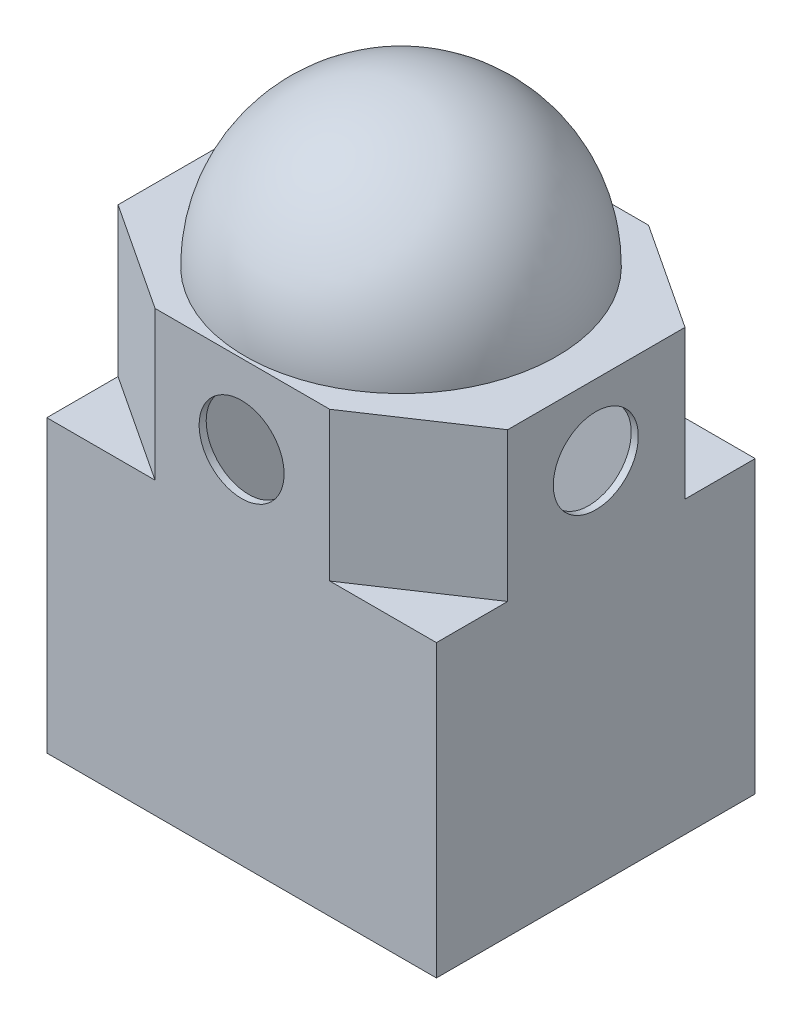
ISO-10303-21;
HEADER;
FILE_DESCRIPTION(('STEP AP214'),'2;1');
FILE_NAME('part.step','',(''),(''),'','','');
FILE_SCHEMA(('AUTOMOTIVE_DESIGN { 1 0 10303 214 1 1 1 1 }'));
ENDSEC;
DATA;
#1=APPLICATION_CONTEXT('core data for automotive mechanical design processes');
#2=APPLICATION_PROTOCOL_DEFINITION('international standard','automotive_design',2000,#1);
#3=PRODUCT_CONTEXT('',#1,'mechanical');
#4=PRODUCT('Part','Part','',(#3));
#5=PRODUCT_RELATED_PRODUCT_CATEGORY('part','',(#4));
#6=PRODUCT_DEFINITION_FORMATION('','',#4);
#7=PRODUCT_DEFINITION_CONTEXT('part definition',#1,'design');
#8=PRODUCT_DEFINITION('design','',#6,#7);
#9=PRODUCT_DEFINITION_SHAPE('','',#8);
#10=(LENGTH_UNIT() NAMED_UNIT(*) SI_UNIT(.MILLI.,.METRE.));
#11=(NAMED_UNIT(*) PLANE_ANGLE_UNIT() SI_UNIT($,.RADIAN.));
#12=(NAMED_UNIT(*) SI_UNIT($,.STERADIAN.) SOLID_ANGLE_UNIT());
#13=UNCERTAINTY_MEASURE_WITH_UNIT(LENGTH_MEASURE(1.E-05),#10,'distance_accuracy_value','');
#14=(GEOMETRIC_REPRESENTATION_CONTEXT(3) GLOBAL_UNCERTAINTY_ASSIGNED_CONTEXT((#13)) GLOBAL_UNIT_ASSIGNED_CONTEXT((#10,
#11,#12)) REPRESENTATION_CONTEXT('',''));
#15=CARTESIAN_POINT('',(0.,0.,0.));
#16=DIRECTION('',(0.,0.,1.));
#17=DIRECTION('',(1.,0.,0.));
#18=AXIS2_PLACEMENT_3D('',#15,#16,#17);
#19=CARTESIAN_POINT('',(0.,124.,0.));
#20=DIRECTION('',(0.,-1.,0.));
#21=DIRECTION('',(0.,0.,-1.));
#22=AXIS2_PLACEMENT_3D('',#19,#20,#21);
#23=PLANE('',#22);
#24=DIRECTION('',(1.,0.,0.));
#25=VECTOR('',#24,1.);
#26=CARTESIAN_POINT('',(11.5,124.,6.5));
#27=LINE('',#26,#25);
#28=CARTESIAN_POINT('',(-11.5,124.,6.5));
#29=VERTEX_POINT('',#28);
#30=CARTESIAN_POINT('',(11.5,124.,6.5));
#31=VERTEX_POINT('',#30);
#32=EDGE_CURVE('E234',#29,#31,#27,.T.);
#33=ORIENTED_EDGE('',*,*,#32,.F.);
#34=DIRECTION('',(0.,0.,1.));
#35=VECTOR('',#34,1.);
#36=CARTESIAN_POINT('',(-11.5,124.,-6.5));
#37=LINE('',#36,#35);
#38=CARTESIAN_POINT('',(-11.5,124.,-6.5));
#39=VERTEX_POINT('',#38);
#40=EDGE_CURVE('E60',#39,#29,#37,.T.);
#41=ORIENTED_EDGE('',*,*,#40,.F.);
#42=DIRECTION('',(-1.,0.,0.));
#43=VECTOR('',#42,1.);
#44=CARTESIAN_POINT('',(11.5,124.,-6.5));
#45=LINE('',#44,#43);
#46=CARTESIAN_POINT('',(11.5,124.,-6.5));
#47=VERTEX_POINT('',#46);
#48=EDGE_CURVE('E240',#47,#39,#45,.T.);
#49=ORIENTED_EDGE('',*,*,#48,.F.);
#50=DIRECTION('',(0.,0.,-1.));
#51=VECTOR('',#50,1.);
#52=CARTESIAN_POINT('',(11.5,124.,-6.5));
#53=LINE('',#52,#51);
#54=EDGE_CURVE('E225',#31,#47,#53,.T.);
#55=ORIENTED_EDGE('',*,*,#54,.F.);
#56=EDGE_LOOP('',(#33,#41,#49,#55));
#57=FACE_BOUND('',#56,.T.);
#58=CARTESIAN_POINT('',(0.,124.,0.));
#59=DIRECTION('',(0.,-1.,0.));
#60=DIRECTION('',(1.,0.,0.));
#61=AXIS2_PLACEMENT_3D('',#58,#59,#60);
#62=CIRCLE('',#61,41.9958270484397);
#63=CARTESIAN_POINT('',(41.9958270484397,124.,0.));
#64=VERTEX_POINT('',#63);
#65=EDGE_CURVE('E458',#64,#64,#62,.T.);
#66=ORIENTED_EDGE('',*,*,#65,.F.);
#67=EDGE_LOOP('',(#66));
#68=FACE_BOUND('',#67,.T.);
#69=ADVANCED_FACE('F35',(#57,#68),#23,.F.);
#70=CARTESIAN_POINT('',(0.,80.,0.));
#71=DIRECTION('',(0.,1.,0.));
#72=DIRECTION('',(0.,0.,1.));
#73=AXIS2_PLACEMENT_3D('',#70,#71,#72);
#74=PLANE('',#73);
#75=DIRECTION('',(0.,0.,-1.));
#76=VECTOR('',#75,1.);
#77=CARTESIAN_POINT('',(53.,80.,-43.));
#78=LINE('',#77,#76);
#79=CARTESIAN_POINT('',(53.,80.,-24.1000047461894));
#80=VERTEX_POINT('',#79);
#81=CARTESIAN_POINT('',(53.,80.,-43.));
#82=VERTEX_POINT('',#81);
#83=EDGE_CURVE('E377',#80,#82,#78,.T.);
#84=ORIENTED_EDGE('',*,*,#83,.F.);
#85=DIRECTION('',(-0.835308360991126,0.,-0.549781722193743));
#86=VECTOR('',#85,1.);
#87=CARTESIAN_POINT('',(27.0873972980896,80.,-41.1551139792333));
#88=LINE('',#87,#86);
#89=CARTESIAN_POINT('',(24.2843781069951,80.,-43.));
#90=VERTEX_POINT('',#89);
#91=EDGE_CURVE('E44',#80,#90,#88,.T.);
#92=ORIENTED_EDGE('',*,*,#91,.T.);
#93=DIRECTION('',(-1.,0.,0.));
#94=VECTOR('',#93,1.);
#95=CARTESIAN_POINT('',(-53.,80.,-43.));
#96=LINE('',#95,#94);
#97=EDGE_CURVE('E382',#82,#90,#96,.T.);
#98=ORIENTED_EDGE('',*,*,#97,.F.);
#99=EDGE_LOOP('',(#84,#92,#98));
#100=FACE_BOUND('',#99,.T.);
#101=ADVANCED_FACE('F464',(#100),#74,.F.);
#102=DIRECTION('',(1.,0.,0.));
#103=VECTOR('',#102,1.);
#104=CARTESIAN_POINT('',(-53.,80.,43.));
#105=LINE('',#104,#103);
#106=CARTESIAN_POINT('',(24.2769691697941,80.,43.));
#107=VERTEX_POINT('',#106);
#108=CARTESIAN_POINT('',(53.,80.,43.));
#109=VERTEX_POINT('',#108);
#110=EDGE_CURVE('E372',#107,#109,#105,.T.);
#111=ORIENTED_EDGE('',*,*,#110,.F.);
#112=DIRECTION('',(0.831555061112771,0.,-0.55544232854342));
#113=VECTOR('',#112,1.);
#114=CARTESIAN_POINT('',(27.3507156150732,80.,40.9468721161612));
#115=LINE('',#114,#113);
#116=CARTESIAN_POINT('',(53.,80.,23.8142745162242));
#117=VERTEX_POINT('',#116);
#118=EDGE_CURVE('E433',#107,#117,#115,.T.);
#119=ORIENTED_EDGE('',*,*,#118,.T.);
#120=EDGE_CURVE('E378',#109,#117,#78,.T.);
#121=ORIENTED_EDGE('',*,*,#120,.F.);
#122=EDGE_LOOP('',(#111,#119,#121));
#123=FACE_BOUND('',#122,.T.);
#124=ADVANCED_FACE('F470',(#123),#74,.F.);
#125=DIRECTION('',(0.,0.,1.));
#126=VECTOR('',#125,1.);
#127=CARTESIAN_POINT('',(-53.,80.,-43.));
#128=LINE('',#127,#126);
#129=CARTESIAN_POINT('',(-53.,80.,23.8055255205694));
#130=VERTEX_POINT('',#129);
#131=CARTESIAN_POINT('',(-53.,80.,43.));
#132=VERTEX_POINT('',#131);
#133=EDGE_CURVE('E373',#130,#132,#128,.T.);
#134=ORIENTED_EDGE('',*,*,#133,.F.);
#135=DIRECTION('',(0.835308360991126,0.,0.549781722193743));
#136=VECTOR('',#135,1.);
#137=CARTESIAN_POINT('',(-26.9521614626596,80.,40.9496440272866));
#138=LINE('',#137,#136);
#139=CARTESIAN_POINT('',(-23.8369624338856,80.,43.));
#140=VERTEX_POINT('',#139);
#141=EDGE_CURVE('E430',#130,#140,#138,.T.);
#142=ORIENTED_EDGE('',*,*,#141,.T.);
#143=EDGE_CURVE('E374',#132,#140,#105,.T.);
#144=ORIENTED_EDGE('',*,*,#143,.F.);
#145=EDGE_LOOP('',(#134,#142,#144));
#146=FACE_BOUND('',#145,.T.);
#147=ADVANCED_FACE('F544',(#146),#74,.F.);
#148=CARTESIAN_POINT('',(0.,82.,0.));
#149=DIRECTION('',(0.,1.,0.));
#150=DIRECTION('',(0.,0.,1.));
#151=AXIS2_PLACEMENT_3D('',#148,#149,#150);
#152=PLANE('',#151);
#153=DIRECTION('',(0.83155506111277,0.,-0.55544232854342));
#154=VECTOR('',#153,1.);
#155=CARTESIAN_POINT('',(24.883494564893,82.,45.));
#156=LINE('',#155,#154);
#157=CARTESIAN_POINT('',(24.8834945648931,82.,45.));
#158=VERTEX_POINT('',#157);
#159=CARTESIAN_POINT('',(55.,82.,24.8834945648923));
#160=VERTEX_POINT('',#159);
#161=EDGE_CURVE('E329',#158,#160,#156,.T.);
#162=ORIENTED_EDGE('',*,*,#161,.F.);
#163=DIRECTION('',(1.,0.,0.));
#164=VECTOR('',#163,1.);
#165=CARTESIAN_POINT('',(-55.,82.,45.));
#166=LINE('',#165,#164);
#167=CARTESIAN_POINT('',(55.,82.,45.));
#168=VERTEX_POINT('',#167);
#169=EDGE_CURVE('E365',#158,#168,#166,.T.);
#170=ORIENTED_EDGE('',*,*,#169,.T.);
#171=DIRECTION('',(0.,0.,-1.));
#172=VECTOR('',#171,1.);
#173=CARTESIAN_POINT('',(55.,82.,-45.));
#174=LINE('',#173,#172);
#175=EDGE_CURVE('E357',#168,#160,#174,.T.);
#176=ORIENTED_EDGE('',*,*,#175,.T.);
#177=EDGE_LOOP('',(#162,#170,#176));
#178=FACE_BOUND('',#177,.T.);
#179=ADVANCED_FACE('F525',(#178),#152,.T.);
#180=DIRECTION('',(0.835308360991126,0.,0.549781722193743));
#181=VECTOR('',#180,1.);
#182=CARTESIAN_POINT('',(-55.,82.,24.8834945648923));
#183=LINE('',#182,#181);
#184=CARTESIAN_POINT('',(-55.,82.,24.8834945648923));
#185=VERTEX_POINT('',#184);
#186=CARTESIAN_POINT('',(-24.4360788917836,82.,45.));
#187=VERTEX_POINT('',#186);
#188=EDGE_CURVE('E326',#185,#187,#183,.T.);
#189=ORIENTED_EDGE('',*,*,#188,.F.);
#190=DIRECTION('',(0.,0.,1.));
#191=VECTOR('',#190,1.);
#192=CARTESIAN_POINT('',(-55.,82.,-45.));
#193=LINE('',#192,#191);
#194=CARTESIAN_POINT('',(-55.,82.,45.));
#195=VERTEX_POINT('',#194);
#196=EDGE_CURVE('E362',#185,#195,#193,.T.);
#197=ORIENTED_EDGE('',*,*,#196,.T.);
#198=EDGE_CURVE('E366',#195,#187,#166,.T.);
#199=ORIENTED_EDGE('',*,*,#198,.T.);
#200=EDGE_LOOP('',(#189,#197,#199));
#201=FACE_BOUND('',#200,.T.);
#202=ADVANCED_FACE('F546',(#201),#152,.T.);
#203=DIRECTION('',(-0.834067643016127,0.,0.551662185466362));
#204=VECTOR('',#203,1.);
#205=CARTESIAN_POINT('',(-25.0307341777019,82.,-45.));
#206=LINE('',#205,#204);
#207=CARTESIAN_POINT('',(-25.0307341777019,82.,-45.));
#208=VERTEX_POINT('',#207);
#209=CARTESIAN_POINT('',(-55.,82.,-25.1779737905123));
#210=VERTEX_POINT('',#209);
#211=EDGE_CURVE('E323',#208,#210,#206,.T.);
#212=ORIENTED_EDGE('',*,*,#211,.F.);
#213=DIRECTION('',(-1.,0.,0.));
#214=VECTOR('',#213,1.);
#215=CARTESIAN_POINT('',(-55.,82.,-45.));
#216=LINE('',#215,#214);
#217=CARTESIAN_POINT('',(-55.,82.,-45.));
#218=VERTEX_POINT('',#217);
#219=EDGE_CURVE('E359',#208,#218,#216,.T.);
#220=ORIENTED_EDGE('',*,*,#219,.T.);
#221=EDGE_CURVE('E363',#218,#210,#193,.T.);
#222=ORIENTED_EDGE('',*,*,#221,.T.);
#223=EDGE_LOOP('',(#212,#220,#222));
#224=FACE_BOUND('',#223,.T.);
#225=ADVANCED_FACE('F536',(#224),#152,.T.);
#226=CARTESIAN_POINT('',(0.,0.,0.));
#227=DIRECTION('',(0.,1.,0.));
#228=DIRECTION('',(0.,0.,1.));
#229=AXIS2_PLACEMENT_3D('',#226,#227,#228);
#230=PLANE('',#229);
#231=DIRECTION('',(0.,0.,-1.));
#232=VECTOR('',#231,1.);
#233=CARTESIAN_POINT('',(55.,0.,-45.));
#234=LINE('',#233,#232);
#235=CARTESIAN_POINT('',(55.,0.,45.));
#236=VERTEX_POINT('',#235);
#237=CARTESIAN_POINT('',(55.,0.,-45.));
#238=VERTEX_POINT('',#237);
#239=EDGE_CURVE('E406',#236,#238,#234,.T.);
#240=ORIENTED_EDGE('',*,*,#239,.F.);
#241=DIRECTION('',(1.,0.,0.));
#242=VECTOR('',#241,1.);
#243=CARTESIAN_POINT('',(-55.,0.,45.));
#244=LINE('',#243,#242);
#245=CARTESIAN_POINT('',(-55.,0.,45.));
#246=VERTEX_POINT('',#245);
#247=EDGE_CURVE('E413',#246,#236,#244,.T.);
#248=ORIENTED_EDGE('',*,*,#247,.F.);
#249=DIRECTION('',(0.,0.,1.));
#250=VECTOR('',#249,1.);
#251=CARTESIAN_POINT('',(-55.,0.,-45.));
#252=LINE('',#251,#250);
#253=CARTESIAN_POINT('',(-55.,0.,-45.));
#254=VERTEX_POINT('',#253);
#255=EDGE_CURVE('E411',#254,#246,#252,.T.);
#256=ORIENTED_EDGE('',*,*,#255,.F.);
#257=DIRECTION('',(-1.,0.,0.));
#258=VECTOR('',#257,1.);
#259=CARTESIAN_POINT('',(-55.,0.,-45.));
#260=LINE('',#259,#258);
#261=EDGE_CURVE('E409',#238,#254,#260,.T.);
#262=ORIENTED_EDGE('',*,*,#261,.F.);
#263=EDGE_LOOP('',(#240,#248,#256,#262));
#264=FACE_BOUND('',#263,.T.);
#265=DIRECTION('',(0.,0.,1.));
#266=VECTOR('',#265,1.);
#267=CARTESIAN_POINT('',(-53.,0.,-43.));
#268=LINE('',#267,#266);
#269=CARTESIAN_POINT('',(-53.,0.,-43.));
#270=VERTEX_POINT('',#269);
#271=CARTESIAN_POINT('',(-53.,0.,43.));
#272=VERTEX_POINT('',#271);
#273=EDGE_CURVE('E368',#270,#272,#268,.T.);
#274=ORIENTED_EDGE('',*,*,#273,.T.);
#275=DIRECTION('',(1.,0.,0.));
#276=VECTOR('',#275,1.);
#277=CARTESIAN_POINT('',(-53.,0.,43.));
#278=LINE('',#277,#276);
#279=CARTESIAN_POINT('',(53.,0.,43.));
#280=VERTEX_POINT('',#279);
#281=EDGE_CURVE('E388',#272,#280,#278,.T.);
#282=ORIENTED_EDGE('',*,*,#281,.T.);
#283=DIRECTION('',(0.,0.,-1.));
#284=VECTOR('',#283,1.);
#285=CARTESIAN_POINT('',(53.,0.,-43.));
#286=LINE('',#285,#284);
#287=CARTESIAN_POINT('',(53.,0.,-43.));
#288=VERTEX_POINT('',#287);
#289=EDGE_CURVE('E391',#280,#288,#286,.T.);
#290=ORIENTED_EDGE('',*,*,#289,.T.);
#291=DIRECTION('',(-1.,0.,0.));
#292=VECTOR('',#291,1.);
#293=CARTESIAN_POINT('',(-53.,0.,-43.));
#294=LINE('',#293,#292);
#295=EDGE_CURVE('E394',#288,#270,#294,.T.);
#296=ORIENTED_EDGE('',*,*,#295,.T.);
#297=EDGE_LOOP('',(#274,#282,#290,#296));
#298=FACE_BOUND('',#297,.T.);
#299=ADVANCED_FACE('F529',(#264,#298),#230,.F.);
#300=CARTESIAN_POINT('',(55.,80.,-45.));
#301=DIRECTION('',(-1.,0.,0.));
#302=DIRECTION('',(0.,0.,1.));
#303=AXIS2_PLACEMENT_3D('',#300,#301,#302);
#304=PLANE('',#303);
#305=CARTESIAN_POINT('',(55.,103.980631389033,0.));
#306=DIRECTION('',(-1.,0.,0.));
#307=DIRECTION('',(0.,0.,1.));
#308=AXIS2_PLACEMENT_3D('',#305,#306,#307);
#309=CIRCLE('',#308,12.);
#310=CARTESIAN_POINT('',(55.,103.980631389033,12.));
#311=VERTEX_POINT('',#310);
#312=EDGE_CURVE('E447',#311,#311,#309,.T.);
#313=ORIENTED_EDGE('',*,*,#312,.T.);
#314=EDGE_LOOP('',(#313));
#315=FACE_BOUND('',#314,.T.);
#316=ORIENTED_EDGE('',*,*,#239,.T.);
#317=DIRECTION('',(0.,-1.,0.));
#318=VECTOR('',#317,1.);
#319=CARTESIAN_POINT('',(55.,80.,-45.));
#320=LINE('',#319,#318);
#321=CARTESIAN_POINT('',(55.,82.,-45.));
#322=VERTEX_POINT('',#321);
#323=EDGE_CURVE('E424',#322,#238,#320,.T.);
#324=ORIENTED_EDGE('',*,*,#323,.F.);
#325=CARTESIAN_POINT('',(55.,82.,-25.1779737905123));
#326=VERTEX_POINT('',#325);
#327=EDGE_CURVE('E356',#326,#322,#174,.T.);
#328=ORIENTED_EDGE('',*,*,#327,.F.);
#329=DIRECTION('',(0.,-1.,0.));
#330=VECTOR('',#329,1.);
#331=CARTESIAN_POINT('',(55.,122.,-25.1779737905123));
#332=LINE('',#331,#330);
#333=CARTESIAN_POINT('',(55.,124.,-25.1779737905123));
#334=VERTEX_POINT('',#333);
#335=EDGE_CURVE('E353',#334,#326,#332,.T.);
#336=ORIENTED_EDGE('',*,*,#335,.F.);
#337=DIRECTION('',(0.,0.,-1.));
#338=VECTOR('',#337,1.);
#339=CARTESIAN_POINT('',(55.,124.,-25.1779737905123));
#340=LINE('',#339,#338);
#341=CARTESIAN_POINT('',(55.,124.,24.8834945648923));
#342=VERTEX_POINT('',#341);
#343=EDGE_CURVE('E259',#342,#334,#340,.T.);
#344=ORIENTED_EDGE('',*,*,#343,.F.);
#345=DIRECTION('',(0.,-1.,0.));
#346=VECTOR('',#345,1.);
#347=CARTESIAN_POINT('',(55.,122.,24.8834945648923));
#348=LINE('',#347,#346);
#349=EDGE_CURVE('E332',#342,#160,#348,.T.);
#350=ORIENTED_EDGE('',*,*,#349,.T.);
#351=ORIENTED_EDGE('',*,*,#175,.F.);
#352=DIRECTION('',(0.,-1.,0.));
#353=VECTOR('',#352,1.);
#354=CARTESIAN_POINT('',(55.,80.,45.));
#355=LINE('',#354,#353);
#356=EDGE_CURVE('E415',#168,#236,#355,.T.);
#357=ORIENTED_EDGE('',*,*,#356,.T.);
#358=EDGE_LOOP('',(#316,#324,#328,#336,#344,#350,#351,#357));
#359=FACE_BOUND('',#358,.T.);
#360=ADVANCED_FACE('F37',(#315,#359),#304,.F.);
#361=CARTESIAN_POINT('',(-55.,80.,-45.));
#362=DIRECTION('',(0.,0.,1.));
#363=DIRECTION('',(1.,0.,0.));
#364=AXIS2_PLACEMENT_3D('',#361,#362,#363);
#365=PLANE('',#364);
#366=CARTESIAN_POINT('',(0.,101.721715456488,-45.));
#367=DIRECTION('',(0.,0.,-1.));
#368=DIRECTION('',(-1.,0.,0.));
#369=AXIS2_PLACEMENT_3D('',#366,#367,#368);
#370=CIRCLE('',#369,12.);
#371=CARTESIAN_POINT('',(-12.,101.721715456488,-45.));
#372=VERTEX_POINT('',#371);
#373=EDGE_CURVE('E440',#372,#372,#370,.T.);
#374=ORIENTED_EDGE('',*,*,#373,.F.);
#375=EDGE_LOOP('',(#374));
#376=FACE_BOUND('',#375,.T.);
#377=ORIENTED_EDGE('',*,*,#261,.T.);
#378=DIRECTION('',(0.,-1.,0.));
#379=VECTOR('',#378,1.);
#380=CARTESIAN_POINT('',(-55.,80.,-45.));
#381=LINE('',#380,#379);
#382=EDGE_CURVE('E421',#218,#254,#381,.T.);
#383=ORIENTED_EDGE('',*,*,#382,.F.);
#384=ORIENTED_EDGE('',*,*,#219,.F.);
#385=DIRECTION('',(0.,-1.,0.));
#386=VECTOR('',#385,1.);
#387=CARTESIAN_POINT('',(-25.0307341777019,122.,-45.));
#388=LINE('',#387,#386);
#389=CARTESIAN_POINT('',(-25.0307341777019,124.,-45.));
#390=VERTEX_POINT('',#389);
#391=EDGE_CURVE('E347',#390,#208,#388,.T.);
#392=ORIENTED_EDGE('',*,*,#391,.F.);
#393=DIRECTION('',(-1.,0.,0.));
#394=VECTOR('',#393,1.);
#395=CARTESIAN_POINT('',(-25.0307341777019,124.,-45.));
#396=LINE('',#395,#394);
#397=CARTESIAN_POINT('',(24.883494564893,124.,-45.));
#398=VERTEX_POINT('',#397);
#399=EDGE_CURVE('E265',#398,#390,#396,.T.);
#400=ORIENTED_EDGE('',*,*,#399,.F.);
#401=DIRECTION('',(0.,-1.,0.));
#402=VECTOR('',#401,1.);
#403=CARTESIAN_POINT('',(24.883494564893,122.,-45.));
#404=LINE('',#403,#402);
#405=CARTESIAN_POINT('',(24.883494564893,82.,-45.));
#406=VERTEX_POINT('',#405);
#407=EDGE_CURVE('E350',#398,#406,#404,.T.);
#408=ORIENTED_EDGE('',*,*,#407,.T.);
#409=EDGE_CURVE('E360',#322,#406,#216,.T.);
#410=ORIENTED_EDGE('',*,*,#409,.F.);
#411=ORIENTED_EDGE('',*,*,#323,.T.);
#412=EDGE_LOOP('',(#377,#383,#384,#392,#400,#408,#410,#411));
#413=FACE_BOUND('',#412,.T.);
#414=ADVANCED_FACE('F504',(#376,#413),#365,.F.);
#415=CARTESIAN_POINT('',(-55.,80.,-45.));
#416=DIRECTION('',(1.,0.,0.));
#417=DIRECTION('',(0.,0.,-1.));
#418=AXIS2_PLACEMENT_3D('',#415,#416,#417);
#419=PLANE('',#418);
#420=CARTESIAN_POINT('',(-55.,103.980631389033,0.));
#421=DIRECTION('',(-1.,0.,0.));
#422=DIRECTION('',(0.,0.,1.));
#423=AXIS2_PLACEMENT_3D('',#420,#421,#422);
#424=CIRCLE('',#423,12.);
#425=CARTESIAN_POINT('',(-55.,103.980631389033,12.));
#426=VERTEX_POINT('',#425);
#427=EDGE_CURVE('E891',#426,#426,#424,.T.);
#428=ORIENTED_EDGE('',*,*,#427,.F.);
#429=EDGE_LOOP('',(#428));
#430=FACE_BOUND('',#429,.T.);
#431=ORIENTED_EDGE('',*,*,#255,.T.);
#432=DIRECTION('',(0.,-1.,0.));
#433=VECTOR('',#432,1.);
#434=CARTESIAN_POINT('',(-55.,80.,45.));
#435=LINE('',#434,#433);
#436=EDGE_CURVE('E418',#195,#246,#435,.T.);
#437=ORIENTED_EDGE('',*,*,#436,.F.);
#438=ORIENTED_EDGE('',*,*,#196,.F.);
#439=DIRECTION('',(0.,-1.,0.));
#440=VECTOR('',#439,1.);
#441=CARTESIAN_POINT('',(-55.,122.,24.8834945648923));
#442=LINE('',#441,#440);
#443=CARTESIAN_POINT('',(-55.,124.,24.8834945648923));
#444=VERTEX_POINT('',#443);
#445=EDGE_CURVE('E341',#444,#185,#442,.T.);
#446=ORIENTED_EDGE('',*,*,#445,.F.);
#447=DIRECTION('',(0.,0.,1.));
#448=VECTOR('',#447,1.);
#449=CARTESIAN_POINT('',(-55.,124.,24.8834945648923));
#450=LINE('',#449,#448);
#451=CARTESIAN_POINT('',(-55.,124.,-25.1779737905123));
#452=VERTEX_POINT('',#451);
#453=EDGE_CURVE('E271',#452,#444,#450,.T.);
#454=ORIENTED_EDGE('',*,*,#453,.F.);
#455=DIRECTION('',(0.,-1.,0.));
#456=VECTOR('',#455,1.);
#457=CARTESIAN_POINT('',(-55.,122.,-25.1779737905123));
#458=LINE('',#457,#456);
#459=EDGE_CURVE('E344',#452,#210,#458,.T.);
#460=ORIENTED_EDGE('',*,*,#459,.T.);
#461=ORIENTED_EDGE('',*,*,#221,.F.);
#462=ORIENTED_EDGE('',*,*,#382,.T.);
#463=EDGE_LOOP('',(#431,#437,#438,#446,#454,#460,#461,#462));
#464=FACE_BOUND('',#463,.T.);
#465=ADVANCED_FACE('F513',(#430,#464),#419,.F.);
#466=CARTESIAN_POINT('',(-55.,80.,45.));
#467=DIRECTION('',(0.,0.,-1.));
#468=DIRECTION('',(-1.,0.,0.));
#469=AXIS2_PLACEMENT_3D('',#466,#467,#468);
#470=PLANE('',#469);
#471=CARTESIAN_POINT('',(0.,101.721715456488,45.));
#472=DIRECTION('',(0.,0.,-1.));
#473=DIRECTION('',(-1.,0.,0.));
#474=AXIS2_PLACEMENT_3D('',#471,#472,#473);
#475=CIRCLE('',#474,12.);
#476=CARTESIAN_POINT('',(-12.,101.721715456488,45.));
#477=VERTEX_POINT('',#476);
#478=EDGE_CURVE('E444',#477,#477,#475,.T.);
#479=ORIENTED_EDGE('',*,*,#478,.T.);
#480=EDGE_LOOP('',(#479));
#481=FACE_BOUND('',#480,.T.);
#482=ORIENTED_EDGE('',*,*,#247,.T.);
#483=ORIENTED_EDGE('',*,*,#356,.F.);
#484=ORIENTED_EDGE('',*,*,#169,.F.);
#485=DIRECTION('',(0.,-1.,0.));
#486=VECTOR('',#485,1.);
#487=CARTESIAN_POINT('',(24.883494564893,122.,45.));
#488=LINE('',#487,#486);
#489=CARTESIAN_POINT('',(24.883494564893,124.,45.));
#490=VERTEX_POINT('',#489);
#491=EDGE_CURVE('E335',#490,#158,#488,.T.);
#492=ORIENTED_EDGE('',*,*,#491,.F.);
#493=DIRECTION('',(1.,0.,0.));
#494=VECTOR('',#493,1.);
#495=CARTESIAN_POINT('',(24.883494564893,124.,45.));
#496=LINE('',#495,#494);
#497=CARTESIAN_POINT('',(-24.4360788917836,124.,45.));
#498=VERTEX_POINT('',#497);
#499=EDGE_CURVE('E277',#498,#490,#496,.T.);
#500=ORIENTED_EDGE('',*,*,#499,.F.);
#501=DIRECTION('',(0.,-1.,0.));
#502=VECTOR('',#501,1.);
#503=CARTESIAN_POINT('',(-24.4360788917836,122.,45.));
#504=LINE('',#503,#502);
#505=EDGE_CURVE('E338',#498,#187,#504,.T.);
#506=ORIENTED_EDGE('',*,*,#505,.T.);
#507=ORIENTED_EDGE('',*,*,#198,.F.);
#508=ORIENTED_EDGE('',*,*,#436,.T.);
#509=EDGE_LOOP('',(#482,#483,#484,#492,#500,#506,#507,#508));
#510=FACE_BOUND('',#509,.T.);
#511=ADVANCED_FACE('F520',(#481,#510),#470,.F.);
#512=CARTESIAN_POINT('',(-53.,80.,-43.));
#513=DIRECTION('',(1.,0.,0.));
#514=DIRECTION('',(0.,0.,-1.));
#515=AXIS2_PLACEMENT_3D('',#512,#513,#514);
#516=PLANE('',#515);
#517=CARTESIAN_POINT('',(-53.,103.980631389033,0.));
#518=DIRECTION('',(1.,0.,0.));
#519=DIRECTION('',(0.,0.,-1.));
#520=AXIS2_PLACEMENT_3D('',#517,#518,#519);
#521=CIRCLE('',#520,12.);
#522=CARTESIAN_POINT('',(-53.,103.980631389033,-12.));
#523=VERTEX_POINT('',#522);
#524=EDGE_CURVE('E452',#523,#523,#521,.T.);
#525=ORIENTED_EDGE('',*,*,#524,.F.);
#526=EDGE_LOOP('',(#525));
#527=FACE_BOUND('',#526,.T.);
#528=CARTESIAN_POINT('',(-53.,80.,-43.));
#529=VERTEX_POINT('',#528);
#530=CARTESIAN_POINT('',(-53.,80.,-24.1029103510234));
#531=VERTEX_POINT('',#530);
#532=EDGE_CURVE('E369',#529,#531,#128,.T.);
#533=ORIENTED_EDGE('',*,*,#532,.T.);
#534=DIRECTION('',(0.,-1.,0.));
#535=VECTOR('',#534,1.);
#536=CARTESIAN_POINT('',(-53.,122.,-24.1029103510234));
#537=LINE('',#536,#535);
#538=CARTESIAN_POINT('',(-53.,122.,-24.1029103510234));
#539=VERTEX_POINT('',#538);
#540=EDGE_CURVE('E312',#539,#531,#537,.T.);
#541=ORIENTED_EDGE('',*,*,#540,.F.);
#542=DIRECTION('',(0.,0.,1.));
#543=VECTOR('',#542,1.);
#544=CARTESIAN_POINT('',(-53.,122.,-24.1029103510234));
#545=LINE('',#544,#543);
#546=CARTESIAN_POINT('',(-53.,122.,23.8055255205694));
#547=VERTEX_POINT('',#546);
#548=EDGE_CURVE('E292',#539,#547,#545,.T.);
#549=ORIENTED_EDGE('',*,*,#548,.T.);
#550=DIRECTION('',(0.,-1.,0.));
#551=VECTOR('',#550,1.);
#552=CARTESIAN_POINT('',(-53.,122.,23.8055255205694));
#553=LINE('',#552,#551);
#554=EDGE_CURVE('E310',#547,#130,#553,.T.);
#555=ORIENTED_EDGE('',*,*,#554,.T.);
#556=ORIENTED_EDGE('',*,*,#133,.T.);
#557=DIRECTION('',(0.,-1.,0.));
#558=VECTOR('',#557,1.);
#559=CARTESIAN_POINT('',(-53.,80.,43.));
#560=LINE('',#559,#558);
#561=EDGE_CURVE('E403',#132,#272,#560,.T.);
#562=ORIENTED_EDGE('',*,*,#561,.T.);
#563=ORIENTED_EDGE('',*,*,#273,.F.);
#564=DIRECTION('',(0.,-1.,0.));
#565=VECTOR('',#564,1.);
#566=CARTESIAN_POINT('',(-53.,80.,-43.));
#567=LINE('',#566,#565);
#568=EDGE_CURVE('E385',#529,#270,#567,.T.);
#569=ORIENTED_EDGE('',*,*,#568,.F.);
#570=EDGE_LOOP('',(#533,#541,#549,#555,#556,#562,#563,#569));
#571=FACE_BOUND('',#570,.T.);
#572=ADVANCED_FACE('F646',(#527,#571),#516,.T.);
#573=CARTESIAN_POINT('',(-53.,80.,43.));
#574=DIRECTION('',(0.,0.,-1.));
#575=DIRECTION('',(-1.,0.,0.));
#576=AXIS2_PLACEMENT_3D('',#573,#574,#575);
#577=PLANE('',#576);
#578=CARTESIAN_POINT('',(0.,101.721715456488,43.));
#579=DIRECTION('',(0.,0.,-1.));
#580=DIRECTION('',(-1.,0.,0.));
#581=AXIS2_PLACEMENT_3D('',#578,#579,#580);
#582=CIRCLE('',#581,12.);
#583=CARTESIAN_POINT('',(-12.,101.721715456488,43.));
#584=VERTEX_POINT('',#583);
#585=EDGE_CURVE('E439',#584,#584,#582,.T.);
#586=ORIENTED_EDGE('',*,*,#585,.F.);
#587=EDGE_LOOP('',(#586));
#588=FACE_BOUND('',#587,.T.);
#589=ORIENTED_EDGE('',*,*,#143,.T.);
#590=DIRECTION('',(0.,-1.,0.));
#591=VECTOR('',#590,1.);
#592=CARTESIAN_POINT('',(-23.8369624338856,122.,43.));
#593=LINE('',#592,#591);
#594=CARTESIAN_POINT('',(-23.8369624338856,122.,43.));
#595=VERTEX_POINT('',#594);
#596=EDGE_CURVE('E308',#595,#140,#593,.T.);
#597=ORIENTED_EDGE('',*,*,#596,.F.);
#598=DIRECTION('',(1.,0.,0.));
#599=VECTOR('',#598,1.);
#600=CARTESIAN_POINT('',(-23.8369624338856,122.,43.));
#601=LINE('',#600,#599);
#602=CARTESIAN_POINT('',(24.2769691697941,122.,43.));
#603=VERTEX_POINT('',#602);
#604=EDGE_CURVE('E298',#595,#603,#601,.T.);
#605=ORIENTED_EDGE('',*,*,#604,.T.);
#606=DIRECTION('',(0.,-1.,0.));
#607=VECTOR('',#606,1.);
#608=CARTESIAN_POINT('',(24.2769691697941,122.,43.));
#609=LINE('',#608,#607);
#610=EDGE_CURVE('E306',#603,#107,#609,.T.);
#611=ORIENTED_EDGE('',*,*,#610,.T.);
#612=ORIENTED_EDGE('',*,*,#110,.T.);
#613=DIRECTION('',(0.,-1.,0.));
#614=VECTOR('',#613,1.);
#615=CARTESIAN_POINT('',(53.,80.,43.));
#616=LINE('',#615,#614);
#617=EDGE_CURVE('E401',#109,#280,#616,.T.);
#618=ORIENTED_EDGE('',*,*,#617,.T.);
#619=ORIENTED_EDGE('',*,*,#281,.F.);
#620=ORIENTED_EDGE('',*,*,#561,.F.);
#621=EDGE_LOOP('',(#589,#597,#605,#611,#612,#618,#619,#620));
#622=FACE_BOUND('',#621,.T.);
#623=ADVANCED_FACE('F810',(#588,#622),#577,.T.);
#624=CARTESIAN_POINT('',(53.,80.,-43.));
#625=DIRECTION('',(-1.,0.,0.));
#626=DIRECTION('',(0.,0.,1.));
#627=AXIS2_PLACEMENT_3D('',#624,#625,#626);
#628=PLANE('',#627);
#629=CARTESIAN_POINT('',(53.,103.980631389033,0.));
#630=DIRECTION('',(-1.,0.,0.));
#631=DIRECTION('',(0.,0.,1.));
#632=AXIS2_PLACEMENT_3D('',#629,#630,#631);
#633=CIRCLE('',#632,12.);
#634=CARTESIAN_POINT('',(53.,103.980631389033,12.));
#635=VERTEX_POINT('',#634);
#636=EDGE_CURVE('E39',#635,#635,#633,.T.);
#637=ORIENTED_EDGE('',*,*,#636,.F.);
#638=EDGE_LOOP('',(#637));
#639=FACE_BOUND('',#638,.T.);
#640=ORIENTED_EDGE('',*,*,#120,.T.);
#641=DIRECTION('',(0.,-1.,0.));
#642=VECTOR('',#641,1.);
#643=CARTESIAN_POINT('',(53.,122.,23.8142745162242));
#644=LINE('',#643,#642);
#645=CARTESIAN_POINT('',(53.,122.,23.8142745162242));
#646=VERTEX_POINT('',#645);
#647=EDGE_CURVE('E304',#646,#117,#644,.T.);
#648=ORIENTED_EDGE('',*,*,#647,.F.);
#649=DIRECTION('',(0.,0.,-1.));
#650=VECTOR('',#649,1.);
#651=CARTESIAN_POINT('',(53.,122.,23.8142745162242));
#652=LINE('',#651,#650);
#653=CARTESIAN_POINT('',(53.,122.,-24.1000047461894));
#654=VERTEX_POINT('',#653);
#655=EDGE_CURVE('E280',#646,#654,#652,.T.);
#656=ORIENTED_EDGE('',*,*,#655,.T.);
#657=DIRECTION('',(0.,-1.,0.));
#658=VECTOR('',#657,1.);
#659=CARTESIAN_POINT('',(53.,122.,-24.1000047461894));
#660=LINE('',#659,#658);
#661=EDGE_CURVE('E318',#654,#80,#660,.T.);
#662=ORIENTED_EDGE('',*,*,#661,.T.);
#663=ORIENTED_EDGE('',*,*,#83,.T.);
#664=DIRECTION('',(0.,-1.,0.));
#665=VECTOR('',#664,1.);
#666=CARTESIAN_POINT('',(53.,80.,-43.));
#667=LINE('',#666,#665);
#668=EDGE_CURVE('E399',#82,#288,#667,.T.);
#669=ORIENTED_EDGE('',*,*,#668,.T.);
#670=ORIENTED_EDGE('',*,*,#289,.F.);
#671=ORIENTED_EDGE('',*,*,#617,.F.);
#672=EDGE_LOOP('',(#640,#648,#656,#662,#663,#669,#670,#671));
#673=FACE_BOUND('',#672,.T.);
#674=ADVANCED_FACE('F815',(#639,#673),#628,.T.);
#675=CARTESIAN_POINT('',(-53.,80.,-43.));
#676=DIRECTION('',(0.,0.,1.));
#677=DIRECTION('',(1.,0.,0.));
#678=AXIS2_PLACEMENT_3D('',#675,#676,#677);
#679=PLANE('',#678);
#680=CARTESIAN_POINT('',(0.,101.721715456488,-43.));
#681=DIRECTION('',(0.,0.,1.));
#682=DIRECTION('',(1.,0.,0.));
#683=AXIS2_PLACEMENT_3D('',#680,#681,#682);
#684=CIRCLE('',#683,12.);
#685=CARTESIAN_POINT('',(12.,101.721715456488,-43.));
#686=VERTEX_POINT('',#685);
#687=EDGE_CURVE('E437',#686,#686,#684,.T.);
#688=ORIENTED_EDGE('',*,*,#687,.F.);
#689=EDGE_LOOP('',(#688));
#690=FACE_BOUND('',#689,.T.);
#691=ORIENTED_EDGE('',*,*,#97,.T.);
#692=DIRECTION('',(0.,-1.,0.));
#693=VECTOR('',#692,1.);
#694=CARTESIAN_POINT('',(24.2843781069951,122.,-43.));
#695=LINE('',#694,#693);
#696=CARTESIAN_POINT('',(24.2843781069951,122.,-43.));
#697=VERTEX_POINT('',#696);
#698=EDGE_CURVE('E316',#697,#90,#695,.T.);
#699=ORIENTED_EDGE('',*,*,#698,.F.);
#700=DIRECTION('',(-1.,0.,0.));
#701=VECTOR('',#700,1.);
#702=CARTESIAN_POINT('',(24.2843781069951,122.,-43.));
#703=LINE('',#702,#701);
#704=CARTESIAN_POINT('',(-24.4291618337733,122.,-43.));
#705=VERTEX_POINT('',#704);
#706=EDGE_CURVE('E286',#697,#705,#703,.T.);
#707=ORIENTED_EDGE('',*,*,#706,.T.);
#708=DIRECTION('',(0.,-1.,0.));
#709=VECTOR('',#708,1.);
#710=CARTESIAN_POINT('',(-24.4291618337733,122.,-43.));
#711=LINE('',#710,#709);
#712=CARTESIAN_POINT('',(-24.4291618337733,80.,-43.));
#713=VERTEX_POINT('',#712);
#714=EDGE_CURVE('E314',#705,#713,#711,.T.);
#715=ORIENTED_EDGE('',*,*,#714,.T.);
#716=EDGE_CURVE('E381',#713,#529,#96,.T.);
#717=ORIENTED_EDGE('',*,*,#716,.T.);
#718=ORIENTED_EDGE('',*,*,#568,.T.);
#719=ORIENTED_EDGE('',*,*,#295,.F.);
#720=ORIENTED_EDGE('',*,*,#668,.F.);
#721=EDGE_LOOP('',(#691,#699,#707,#715,#717,#718,#719,#720));
#722=FACE_BOUND('',#721,.T.);
#723=ADVANCED_FACE('F542',(#690,#722),#679,.T.);
#724=ORIENTED_EDGE('',*,*,#716,.F.);
#725=DIRECTION('',(-0.834067643016127,0.,0.551662185466362));
#726=VECTOR('',#725,1.);
#727=CARTESIAN_POINT('',(-27.2198692138557,80.,-41.1541931938204));
#728=LINE('',#727,#726);
#729=EDGE_CURVE('E427',#713,#531,#728,.T.);
#730=ORIENTED_EDGE('',*,*,#729,.T.);
#731=ORIENTED_EDGE('',*,*,#532,.F.);
#732=EDGE_LOOP('',(#724,#730,#731));
#733=FACE_BOUND('',#732,.T.);
#734=ADVANCED_FACE('F473',(#733),#74,.F.);
#735=DIRECTION('',(-0.835308360991126,0.,-0.549781722193743));
#736=VECTOR('',#735,1.);
#737=CARTESIAN_POINT('',(55.,82.,-25.1779737905123));
#738=LINE('',#737,#736);
#739=EDGE_CURVE('E320',#326,#406,#738,.T.);
#740=ORIENTED_EDGE('',*,*,#739,.F.);
#741=ORIENTED_EDGE('',*,*,#327,.T.);
#742=ORIENTED_EDGE('',*,*,#409,.T.);
#743=EDGE_LOOP('',(#740,#741,#742));
#744=FACE_BOUND('',#743,.T.);
#745=ADVANCED_FACE('F533',(#744),#152,.T.);
#746=CARTESIAN_POINT('',(55.,122.,-25.1779737905123));
#747=DIRECTION('',(-0.549781722193743,0.,0.835308360991126));
#748=DIRECTION('',(0.835308360991126,0.,0.549781722193743));
#749=AXIS2_PLACEMENT_3D('',#746,#747,#748);
#750=PLANE('',#749);
#751=ORIENTED_EDGE('',*,*,#739,.T.);
#752=ORIENTED_EDGE('',*,*,#407,.F.);
#753=DIRECTION('',(-0.835308360991126,0.,-0.549781722193743));
#754=VECTOR('',#753,1.);
#755=CARTESIAN_POINT('',(24.883494564893,124.,-45.));
#756=LINE('',#755,#754);
#757=EDGE_CURVE('E262',#334,#398,#756,.T.);
#758=ORIENTED_EDGE('',*,*,#757,.F.);
#759=ORIENTED_EDGE('',*,*,#335,.T.);
#760=EDGE_LOOP('',(#751,#752,#758,#759));
#761=FACE_BOUND('',#760,.T.);
#762=ADVANCED_FACE('F500',(#761),#750,.F.);
#763=CARTESIAN_POINT('',(-25.0307341777019,122.,-45.));
#764=DIRECTION('',(0.551662185466362,0.,0.834067643016127));
#765=DIRECTION('',(0.834067643016127,0.,-0.551662185466362));
#766=AXIS2_PLACEMENT_3D('',#763,#764,#765);
#767=PLANE('',#766);
#768=ORIENTED_EDGE('',*,*,#211,.T.);
#769=ORIENTED_EDGE('',*,*,#459,.F.);
#770=DIRECTION('',(-0.834067643016127,0.,0.551662185466362));
#771=VECTOR('',#770,1.);
#772=CARTESIAN_POINT('',(-55.,124.,-25.1779737905123));
#773=LINE('',#772,#771);
#774=EDGE_CURVE('E268',#390,#452,#773,.T.);
#775=ORIENTED_EDGE('',*,*,#774,.F.);
#776=ORIENTED_EDGE('',*,*,#391,.T.);
#777=EDGE_LOOP('',(#768,#769,#775,#776));
#778=FACE_BOUND('',#777,.T.);
#779=ADVANCED_FACE('F509',(#778),#767,.F.);
#780=CARTESIAN_POINT('',(-55.,122.,24.8834945648923));
#781=DIRECTION('',(0.549781722193743,0.,-0.835308360991126));
#782=DIRECTION('',(-0.835308360991126,0.,-0.549781722193743));
#783=AXIS2_PLACEMENT_3D('',#780,#781,#782);
#784=PLANE('',#783);
#785=ORIENTED_EDGE('',*,*,#188,.T.);
#786=ORIENTED_EDGE('',*,*,#505,.F.);
#787=DIRECTION('',(0.835308360991126,0.,0.549781722193743));
#788=VECTOR('',#787,1.);
#789=CARTESIAN_POINT('',(-24.4360788917836,124.,45.));
#790=LINE('',#789,#788);
#791=EDGE_CURVE('E274',#444,#498,#790,.T.);
#792=ORIENTED_EDGE('',*,*,#791,.F.);
#793=ORIENTED_EDGE('',*,*,#445,.T.);
#794=EDGE_LOOP('',(#785,#786,#792,#793));
#795=FACE_BOUND('',#794,.T.);
#796=ADVANCED_FACE('F518',(#795),#784,.F.);
#797=CARTESIAN_POINT('',(24.883494564893,122.,45.));
#798=DIRECTION('',(-0.55544232854342,0.,-0.83155506111277));
#799=DIRECTION('',(-0.831555061112771,0.,0.55544232854342));
#800=AXIS2_PLACEMENT_3D('',#797,#798,#799);
#801=PLANE('',#800);
#802=ORIENTED_EDGE('',*,*,#161,.T.);
#803=ORIENTED_EDGE('',*,*,#349,.F.);
#804=DIRECTION('',(0.83155506111277,0.,-0.55544232854342));
#805=VECTOR('',#804,1.);
#806=CARTESIAN_POINT('',(55.,124.,24.8834945648923));
#807=LINE('',#806,#805);
#808=EDGE_CURVE('E256',#490,#342,#807,.T.);
#809=ORIENTED_EDGE('',*,*,#808,.F.);
#810=ORIENTED_EDGE('',*,*,#491,.T.);
#811=EDGE_LOOP('',(#802,#803,#809,#810));
#812=FACE_BOUND('',#811,.T.);
#813=ADVANCED_FACE('F494',(#812),#801,.F.);
#814=CARTESIAN_POINT('',(53.,122.,-24.1000047461894));
#815=DIRECTION('',(-0.549781722193743,0.,0.835308360991126));
#816=DIRECTION('',(0.835308360991126,0.,0.549781722193743));
#817=AXIS2_PLACEMENT_3D('',#814,#815,#816);
#818=PLANE('',#817);
#819=ORIENTED_EDGE('',*,*,#698,.T.);
#820=ORIENTED_EDGE('',*,*,#91,.F.);
#821=ORIENTED_EDGE('',*,*,#661,.F.);
#822=DIRECTION('',(-0.835308360991126,0.,-0.549781722193743));
#823=VECTOR('',#822,1.);
#824=CARTESIAN_POINT('',(53.,122.,-24.1000047461894));
#825=LINE('',#824,#823);
#826=EDGE_CURVE('E283',#654,#697,#825,.T.);
#827=ORIENTED_EDGE('',*,*,#826,.T.);
#828=EDGE_LOOP('',(#819,#820,#821,#827));
#829=FACE_BOUND('',#828,.T.);
#830=ADVANCED_FACE('F685',(#829),#818,.T.);
#831=CARTESIAN_POINT('',(-24.4291618337733,122.,-43.));
#832=DIRECTION('',(0.551662185466362,0.,0.834067643016127));
#833=DIRECTION('',(0.834067643016127,0.,-0.551662185466362));
#834=AXIS2_PLACEMENT_3D('',#831,#832,#833);
#835=PLANE('',#834);
#836=ORIENTED_EDGE('',*,*,#540,.T.);
#837=ORIENTED_EDGE('',*,*,#729,.F.);
#838=ORIENTED_EDGE('',*,*,#714,.F.);
#839=DIRECTION('',(-0.834067643016127,0.,0.551662185466362));
#840=VECTOR('',#839,1.);
#841=CARTESIAN_POINT('',(-24.4291618337733,122.,-43.));
#842=LINE('',#841,#840);
#843=EDGE_CURVE('E289',#705,#539,#842,.T.);
#844=ORIENTED_EDGE('',*,*,#843,.T.);
#845=EDGE_LOOP('',(#836,#837,#838,#844));
#846=FACE_BOUND('',#845,.T.);
#847=ADVANCED_FACE('F696',(#846),#835,.T.);
#848=CARTESIAN_POINT('',(-53.,122.,23.8055255205694));
#849=DIRECTION('',(0.549781722193743,0.,-0.835308360991126));
#850=DIRECTION('',(-0.835308360991126,0.,-0.549781722193743));
#851=AXIS2_PLACEMENT_3D('',#848,#849,#850);
#852=PLANE('',#851);
#853=ORIENTED_EDGE('',*,*,#596,.T.);
#854=ORIENTED_EDGE('',*,*,#141,.F.);
#855=ORIENTED_EDGE('',*,*,#554,.F.);
#856=DIRECTION('',(0.835308360991126,0.,0.549781722193743));
#857=VECTOR('',#856,1.);
#858=CARTESIAN_POINT('',(-53.,122.,23.8055255205694));
#859=LINE('',#858,#857);
#860=EDGE_CURVE('E295',#547,#595,#859,.T.);
#861=ORIENTED_EDGE('',*,*,#860,.T.);
#862=EDGE_LOOP('',(#853,#854,#855,#861));
#863=FACE_BOUND('',#862,.T.);
#864=ADVANCED_FACE('F708',(#863),#852,.T.);
#865=CARTESIAN_POINT('',(24.2769691697941,122.,43.));
#866=DIRECTION('',(-0.55544232854342,0.,-0.83155506111277));
#867=DIRECTION('',(-0.83155506111277,0.,0.55544232854342));
#868=AXIS2_PLACEMENT_3D('',#865,#866,#867);
#869=PLANE('',#868);
#870=ORIENTED_EDGE('',*,*,#647,.T.);
#871=ORIENTED_EDGE('',*,*,#118,.F.);
#872=ORIENTED_EDGE('',*,*,#610,.F.);
#873=DIRECTION('',(0.83155506111277,0.,-0.55544232854342));
#874=VECTOR('',#873,1.);
#875=CARTESIAN_POINT('',(24.2769691697941,122.,43.));
#876=LINE('',#875,#874);
#877=EDGE_CURVE('E301',#603,#646,#876,.T.);
#878=ORIENTED_EDGE('',*,*,#877,.T.);
#879=EDGE_LOOP('',(#870,#871,#872,#878));
#880=FACE_BOUND('',#879,.T.);
#881=ADVANCED_FACE('F485',(#880),#869,.T.);
#882=CARTESIAN_POINT('',(0.,122.,0.));
#883=DIRECTION('',(0.,-1.,0.));
#884=DIRECTION('',(0.,0.,-1.));
#885=AXIS2_PLACEMENT_3D('',#882,#883,#884);
#886=PLANE('',#885);
#887=DIRECTION('',(0.,0.,-1.));
#888=VECTOR('',#887,1.);
#889=CARTESIAN_POINT('',(-11.5,122.,0.));
#890=LINE('',#889,#888);
#891=CARTESIAN_POINT('',(-11.5,122.,6.5));
#892=VERTEX_POINT('',#891);
#893=CARTESIAN_POINT('',(-11.5,122.,-6.5));
#894=VERTEX_POINT('',#893);
#895=EDGE_CURVE('E254',#892,#894,#890,.T.);
#896=ORIENTED_EDGE('',*,*,#895,.F.);
#897=DIRECTION('',(-1.,0.,0.));
#898=VECTOR('',#897,1.);
#899=CARTESIAN_POINT('',(0.,122.,6.5));
#900=LINE('',#899,#898);
#901=CARTESIAN_POINT('',(11.5,122.,6.5));
#902=VERTEX_POINT('',#901);
#903=EDGE_CURVE('E247',#902,#892,#900,.T.);
#904=ORIENTED_EDGE('',*,*,#903,.F.);
#905=DIRECTION('',(0.,0.,1.));
#906=VECTOR('',#905,1.);
#907=CARTESIAN_POINT('',(11.5,122.,0.));
#908=LINE('',#907,#906);
#909=CARTESIAN_POINT('',(11.5,122.,-6.5));
#910=VERTEX_POINT('',#909);
#911=EDGE_CURVE('E228',#910,#902,#908,.T.);
#912=ORIENTED_EDGE('',*,*,#911,.F.);
#913=DIRECTION('',(1.,0.,0.));
#914=VECTOR('',#913,1.);
#915=CARTESIAN_POINT('',(0.,122.,-6.5));
#916=LINE('',#915,#914);
#917=EDGE_CURVE('E252',#894,#910,#916,.T.);
#918=ORIENTED_EDGE('',*,*,#917,.F.);
#919=EDGE_LOOP('',(#896,#904,#912,#918));
#920=FACE_BOUND('',#919,.T.);
#921=ORIENTED_EDGE('',*,*,#826,.F.);
#922=ORIENTED_EDGE('',*,*,#655,.F.);
#923=ORIENTED_EDGE('',*,*,#877,.F.);
#924=ORIENTED_EDGE('',*,*,#604,.F.);
#925=ORIENTED_EDGE('',*,*,#860,.F.);
#926=ORIENTED_EDGE('',*,*,#548,.F.);
#927=ORIENTED_EDGE('',*,*,#843,.F.);
#928=ORIENTED_EDGE('',*,*,#706,.F.);
#929=EDGE_LOOP('',(#921,#922,#923,#924,#925,#926,#927,#928));
#930=FACE_BOUND('',#929,.T.);
#931=ADVANCED_FACE('F478',(#920,#930),#886,.T.);
#932=CARTESIAN_POINT('',(0.,124.,0.));
#933=DIRECTION('',(0.,-1.,0.));
#934=DIRECTION('',(0.,0.,-1.));
#935=AXIS2_PLACEMENT_3D('',#932,#933,#934);
#936=CIRCLE('',#935,43.9958270484397);
#937=CARTESIAN_POINT('',(0.,124.,-43.9958270484397));
#938=VERTEX_POINT('',#937);
#939=EDGE_CURVE('E11',#938,#938,#936,.F.);
#940=ORIENTED_EDGE('',*,*,#939,.F.);
#941=EDGE_LOOP('',(#940));
#942=FACE_BOUND('',#941,.T.);
#943=ORIENTED_EDGE('',*,*,#808,.T.);
#944=ORIENTED_EDGE('',*,*,#343,.T.);
#945=ORIENTED_EDGE('',*,*,#757,.T.);
#946=ORIENTED_EDGE('',*,*,#399,.T.);
#947=ORIENTED_EDGE('',*,*,#774,.T.);
#948=ORIENTED_EDGE('',*,*,#453,.T.);
#949=ORIENTED_EDGE('',*,*,#791,.T.);
#950=ORIENTED_EDGE('',*,*,#499,.T.);
#951=EDGE_LOOP('',(#943,#944,#945,#946,#947,#948,#949,#950));
#952=FACE_BOUND('',#951,.T.);
#953=ADVANCED_FACE('F466',(#942,#952),#23,.F.);
#954=CARTESIAN_POINT('',(-11.5,111.,-6.5));
#955=DIRECTION('',(-1.,0.,0.));
#956=DIRECTION('',(0.,0.,1.));
#957=AXIS2_PLACEMENT_3D('',#954,#955,#956);
#958=PLANE('',#957);
#959=ORIENTED_EDGE('',*,*,#895,.T.);
#960=DIRECTION('',(0.,1.,0.));
#961=VECTOR('',#960,1.);
#962=CARTESIAN_POINT('',(-11.5,111.,-6.5));
#963=LINE('',#962,#961);
#964=EDGE_CURVE('E245',#894,#39,#963,.T.);
#965=ORIENTED_EDGE('',*,*,#964,.T.);
#966=ORIENTED_EDGE('',*,*,#40,.T.);
#967=DIRECTION('',(0.,1.,0.));
#968=VECTOR('',#967,1.);
#969=CARTESIAN_POINT('',(-11.5,111.,6.5));
#970=LINE('',#969,#968);
#971=EDGE_CURVE('E231',#892,#29,#970,.T.);
#972=ORIENTED_EDGE('',*,*,#971,.F.);
#973=EDGE_LOOP('',(#959,#965,#966,#972));
#974=FACE_BOUND('',#973,.T.);
#975=ADVANCED_FACE('F477',(#974),#958,.F.);
#976=CARTESIAN_POINT('',(11.5,111.,-6.5));
#977=DIRECTION('',(0.,0.,-1.));
#978=DIRECTION('',(-1.,0.,0.));
#979=AXIS2_PLACEMENT_3D('',#976,#977,#978);
#980=PLANE('',#979);
#981=ORIENTED_EDGE('',*,*,#917,.T.);
#982=DIRECTION('',(0.,1.,0.));
#983=VECTOR('',#982,1.);
#984=CARTESIAN_POINT('',(11.5,111.,-6.5));
#985=LINE('',#984,#983);
#986=EDGE_CURVE('E230',#910,#47,#985,.T.);
#987=ORIENTED_EDGE('',*,*,#986,.T.);
#988=ORIENTED_EDGE('',*,*,#48,.T.);
#989=ORIENTED_EDGE('',*,*,#964,.F.);
#990=EDGE_LOOP('',(#981,#987,#988,#989));
#991=FACE_BOUND('',#990,.T.);
#992=ADVANCED_FACE('F484',(#991),#980,.F.);
#993=CARTESIAN_POINT('',(11.5,111.,-6.5));
#994=DIRECTION('',(1.,0.,0.));
#995=DIRECTION('',(0.,0.,-1.));
#996=AXIS2_PLACEMENT_3D('',#993,#994,#995);
#997=PLANE('',#996);
#998=ORIENTED_EDGE('',*,*,#911,.T.);
#999=DIRECTION('',(0.,1.,0.));
#1000=VECTOR('',#999,1.);
#1001=CARTESIAN_POINT('',(11.5,111.,6.5));
#1002=LINE('',#1001,#1000);
#1003=EDGE_CURVE('E52',#902,#31,#1002,.T.);
#1004=ORIENTED_EDGE('',*,*,#1003,.T.);
#1005=ORIENTED_EDGE('',*,*,#54,.T.);
#1006=ORIENTED_EDGE('',*,*,#986,.F.);
#1007=EDGE_LOOP('',(#998,#1004,#1005,#1006));
#1008=FACE_BOUND('',#1007,.T.);
#1009=ADVANCED_FACE('F222',(#1008),#997,.F.);
#1010=CARTESIAN_POINT('',(11.5,111.,6.5));
#1011=DIRECTION('',(0.,0.,1.));
#1012=DIRECTION('',(1.,0.,0.));
#1013=AXIS2_PLACEMENT_3D('',#1010,#1011,#1012);
#1014=PLANE('',#1013);
#1015=ORIENTED_EDGE('',*,*,#903,.T.);
#1016=ORIENTED_EDGE('',*,*,#971,.T.);
#1017=ORIENTED_EDGE('',*,*,#32,.T.);
#1018=ORIENTED_EDGE('',*,*,#1003,.F.);
#1019=EDGE_LOOP('',(#1015,#1016,#1017,#1018));
#1020=FACE_BOUND('',#1019,.T.);
#1021=ADVANCED_FACE('F235',(#1020),#1014,.F.);
#1022=CARTESIAN_POINT('',(0.,124.,0.));
#1023=DIRECTION('',(1.,0.,0.));
#1024=DIRECTION('',(0.,0.,1.));
#1025=AXIS2_PLACEMENT_3D('',#1022,#1023,#1024);
#1026=SPHERICAL_SURFACE('',#1025,41.9958270484397);
#1027=CARTESIAN_POINT('',(0.,124.,0.));
#1028=DIRECTION('',(0.,-1.,0.));
#1029=DIRECTION('',(1.,0.,0.));
#1030=AXIS2_PLACEMENT_3D('',#1027,#1028,#1029);
#1031=SPHERICAL_SURFACE('',#1030,41.9958270484397);
#1032=ORIENTED_EDGE('',*,*,#65,.T.);
#1033=EDGE_LOOP('',(#1032));
#1034=FACE_BOUND('',#1033,.T.);
#1035=ADVANCED_FACE('F462',(#1034),#1031,.F.);
#1036=CARTESIAN_POINT('',(0.,124.,0.));
#1037=DIRECTION('',(1.,0.,0.));
#1038=DIRECTION('',(0.,0.,1.));
#1039=AXIS2_PLACEMENT_3D('',#1036,#1037,#1038);
#1040=SPHERICAL_SURFACE('',#1039,43.9958270484397);
#1041=CARTESIAN_POINT('',(0.,124.,0.));
#1042=DIRECTION('',(0.,-1.,0.));
#1043=DIRECTION('',(0.,0.,-1.));
#1044=AXIS2_PLACEMENT_3D('',#1041,#1042,#1043);
#1045=SPHERICAL_SURFACE('',#1044,43.9958270484397);
#1046=ORIENTED_EDGE('',*,*,#939,.T.);
#1047=EDGE_LOOP('',(#1046));
#1048=FACE_BOUND('',#1047,.T.);
#1049=ADVANCED_FACE('F788',(#1048),#1045,.T.);
#1050=CARTESIAN_POINT('',(0.,101.721715456488,52.));
#1051=DIRECTION('',(0.,0.,-1.));
#1052=DIRECTION('',(-1.,0.,0.));
#1053=AXIS2_PLACEMENT_3D('',#1050,#1051,#1052);
#1054=CYLINDRICAL_SURFACE('',#1053,12.);
#1055=ORIENTED_EDGE('',*,*,#687,.T.);
#1056=EDGE_LOOP('',(#1055));
#1057=FACE_BOUND('',#1056,.T.);
#1058=ORIENTED_EDGE('',*,*,#373,.T.);
#1059=EDGE_LOOP('',(#1058));
#1060=FACE_BOUND('',#1059,.T.);
#1061=ADVANCED_FACE('F796',(#1057,#1060),#1054,.F.);
#1062=ORIENTED_EDGE('',*,*,#585,.T.);
#1063=EDGE_LOOP('',(#1062));
#1064=FACE_BOUND('',#1063,.T.);
#1065=ORIENTED_EDGE('',*,*,#478,.F.);
#1066=EDGE_LOOP('',(#1065));
#1067=FACE_BOUND('',#1066,.T.);
#1068=ADVANCED_FACE('F835',(#1064,#1067),#1054,.F.);
#1069=CARTESIAN_POINT('',(57.,103.980631389033,0.));
#1070=DIRECTION('',(-1.,0.,0.));
#1071=DIRECTION('',(0.,0.,1.));
#1072=AXIS2_PLACEMENT_3D('',#1069,#1070,#1071);
#1073=CYLINDRICAL_SURFACE('',#1072,12.);
#1074=ORIENTED_EDGE('',*,*,#636,.T.);
#1075=EDGE_LOOP('',(#1074));
#1076=FACE_BOUND('',#1075,.T.);
#1077=ORIENTED_EDGE('',*,*,#312,.F.);
#1078=EDGE_LOOP('',(#1077));
#1079=FACE_BOUND('',#1078,.T.);
#1080=ADVANCED_FACE('F843',(#1076,#1079),#1073,.F.);
#1081=ORIENTED_EDGE('',*,*,#524,.T.);
#1082=EDGE_LOOP('',(#1081));
#1083=FACE_BOUND('',#1082,.T.);
#1084=ORIENTED_EDGE('',*,*,#427,.T.);
#1085=EDGE_LOOP('',(#1084));
#1086=FACE_BOUND('',#1085,.T.);
#1087=ADVANCED_FACE('F873',(#1083,#1086),#1073,.F.);
#1088=CLOSED_SHELL('',(#69,#101,#124,#147,#179,#202,#225,#299,#360,#414,#465,#511,#572,#623,
#674,#723,#734,#745,#762,#779,#796,#813,#830,#847,#864,#881,#931,#953,#975,#992,#1009,#1021,
#1035,#1049,#1061,#1068,#1080,#1087));
#1089=MANIFOLD_SOLID_BREP('B2',#1088);
#1090=ADVANCED_BREP_SHAPE_REPRESENTATION('',(#18,#1089),#14);
#1091=SHAPE_DEFINITION_REPRESENTATION(#9,#1090);
ENDSEC;
END-ISO-10303-21;
